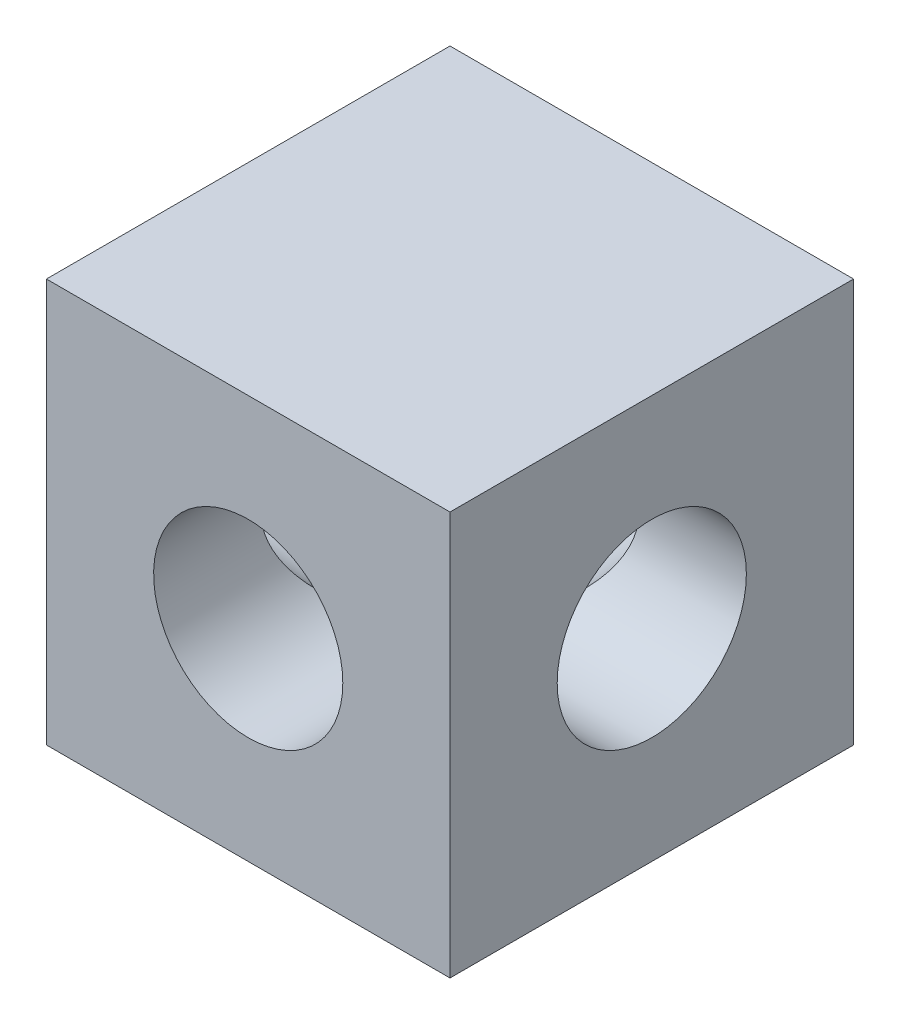
ISO-10303-21;
HEADER;
FILE_DESCRIPTION(('STEP AP214'),'2;1');
FILE_NAME('part.step','',(''),(''),'','','');
FILE_SCHEMA(('AUTOMOTIVE_DESIGN { 1 0 10303 214 1 1 1 1 }'));
ENDSEC;
DATA;
#1=APPLICATION_CONTEXT('core data for automotive mechanical design processes');
#2=APPLICATION_PROTOCOL_DEFINITION('international standard','automotive_design',2000,#1);
#3=PRODUCT_CONTEXT('',#1,'mechanical');
#4=PRODUCT('Part','Part','',(#3));
#5=PRODUCT_RELATED_PRODUCT_CATEGORY('part','',(#4));
#6=PRODUCT_DEFINITION_FORMATION('','',#4);
#7=PRODUCT_DEFINITION_CONTEXT('part definition',#1,'design');
#8=PRODUCT_DEFINITION('design','',#6,#7);
#9=PRODUCT_DEFINITION_SHAPE('','',#8);
#10=(LENGTH_UNIT() NAMED_UNIT(*) SI_UNIT(.MILLI.,.METRE.));
#11=(NAMED_UNIT(*) PLANE_ANGLE_UNIT() SI_UNIT($,.RADIAN.));
#12=(NAMED_UNIT(*) SI_UNIT($,.STERADIAN.) SOLID_ANGLE_UNIT());
#13=UNCERTAINTY_MEASURE_WITH_UNIT(LENGTH_MEASURE(1.E-05),#10,'distance_accuracy_value','');
#14=(GEOMETRIC_REPRESENTATION_CONTEXT(3) GLOBAL_UNCERTAINTY_ASSIGNED_CONTEXT((#13)) GLOBAL_UNIT_ASSIGNED_CONTEXT((#10,
#11,#12)) REPRESENTATION_CONTEXT('',''));
#15=CARTESIAN_POINT('',(0.,0.,0.));
#16=DIRECTION('',(0.,0.,1.));
#17=DIRECTION('',(1.,0.,0.));
#18=AXIS2_PLACEMENT_3D('',#15,#16,#17);
#19=CARTESIAN_POINT('',(0.,0.,10.16));
#20=DIRECTION('',(0.,0.,-0.999999999999999));
#21=DIRECTION('',(-1.,0.,0.));
#22=AXIS2_PLACEMENT_3D('',#19,#20,#21);
#23=CYLINDRICAL_SURFACE('',#22,4.7625);
#24=CARTESIAN_POINT('',(0.,0.,0.));
#25=DIRECTION('',(0.707106781186547,0.,-0.707106781186547));
#26=DIRECTION('',(-0.707106781186547,0.,-0.707106781186547));
#27=AXIS2_PLACEMENT_3D('',#24,#25,#26);
#28=ELLIPSE('',#27,6.73519209080187,4.7625);
#29=CARTESIAN_POINT('',(0.,-4.76249999999992,0.));
#30=VERTEX_POINT('',#29);
#31=CARTESIAN_POINT('',(0.,4.7625000000002,0.));
#32=VERTEX_POINT('',#31);
#33=EDGE_CURVE('E13',#30,#32,#28,.F.);
#34=ORIENTED_EDGE('',*,*,#33,.F.);
#35=CARTESIAN_POINT('',(0.,0.,0.));
#36=DIRECTION('',(-0.707106781186547,0.,-0.707106781186547));
#37=DIRECTION('',(0.707106781186547,0.,-0.707106781186547));
#38=AXIS2_PLACEMENT_3D('',#35,#36,#37);
#39=ELLIPSE('',#38,6.73519209080187,4.7625);
#40=EDGE_CURVE('E63',#32,#30,#39,.F.);
#41=ORIENTED_EDGE('',*,*,#40,.F.);
#42=EDGE_LOOP('',(#34,#41));
#43=FACE_BOUND('',#42,.T.);
#44=CARTESIAN_POINT('',(0.,0.,10.16));
#45=DIRECTION('',(0.,0.,0.999999999999999));
#46=DIRECTION('',(1.,0.,0.));
#47=AXIS2_PLACEMENT_3D('',#44,#45,#46);
#48=CIRCLE('',#47,4.7625);
#49=CARTESIAN_POINT('',(4.7625,0.,10.16));
#50=VERTEX_POINT('',#49);
#51=EDGE_CURVE('E140',#50,#50,#48,.T.);
#52=ORIENTED_EDGE('',*,*,#51,.T.);
#53=EDGE_LOOP('',(#52));
#54=FACE_BOUND('',#53,.T.);
#55=ADVANCED_FACE('F49',(#43,#54),#23,.F.);
#56=CARTESIAN_POINT('',(-10.16,10.16,10.16));
#57=DIRECTION('',(0.,0.,0.999999999999999));
#58=DIRECTION('',(1.,0.,0.));
#59=AXIS2_PLACEMENT_3D('',#56,#57,#58);
#60=PLANE('',#59);
#61=DIRECTION('',(0.,0.999999999999999,0.));
#62=VECTOR('',#61,1.);
#63=CARTESIAN_POINT('',(-10.16,-10.1599999999998,10.16));
#64=LINE('',#63,#62);
#65=CARTESIAN_POINT('',(-10.16,-10.1599999999998,10.16));
#66=VERTEX_POINT('',#65);
#67=CARTESIAN_POINT('',(-10.16,10.16,10.16));
#68=VERTEX_POINT('',#67);
#69=EDGE_CURVE('E125',#66,#68,#64,.T.);
#70=ORIENTED_EDGE('',*,*,#69,.F.);
#71=DIRECTION('',(1.,0.,0.));
#72=VECTOR('',#71,1.);
#73=CARTESIAN_POINT('',(-10.16,-10.1599999999998,10.16));
#74=LINE('',#73,#72);
#75=CARTESIAN_POINT('',(10.16,-10.1599999999998,10.16));
#76=VERTEX_POINT('',#75);
#77=EDGE_CURVE('E114',#66,#76,#74,.T.);
#78=ORIENTED_EDGE('',*,*,#77,.T.);
#79=DIRECTION('',(0.,-1.,0.));
#80=VECTOR('',#79,1.);
#81=CARTESIAN_POINT('',(10.16,10.1600000000002,10.16));
#82=LINE('',#81,#80);
#83=CARTESIAN_POINT('',(10.16,10.1600000000002,10.16));
#84=VERTEX_POINT('',#83);
#85=EDGE_CURVE('E120',#84,#76,#82,.T.);
#86=ORIENTED_EDGE('',*,*,#85,.F.);
#87=DIRECTION('',(-1.,0.,0.));
#88=VECTOR('',#87,1.);
#89=CARTESIAN_POINT('',(10.16,10.1600000000002,10.16));
#90=LINE('',#89,#88);
#91=EDGE_CURVE('E123',#84,#68,#90,.T.);
#92=ORIENTED_EDGE('',*,*,#91,.T.);
#93=EDGE_LOOP('',(#70,#78,#86,#92));
#94=FACE_BOUND('',#93,.T.);
#95=ORIENTED_EDGE('',*,*,#51,.F.);
#96=EDGE_LOOP('',(#95));
#97=FACE_BOUND('',#96,.T.);
#98=ADVANCED_FACE('F172',(#94,#97),#60,.T.);
#99=CARTESIAN_POINT('',(-10.16,10.16,-10.16));
#100=DIRECTION('',(0.,0.,0.999999999999999));
#101=DIRECTION('',(1.,0.,0.));
#102=AXIS2_PLACEMENT_3D('',#99,#100,#101);
#103=PLANE('',#102);
#104=DIRECTION('',(0.,0.999999999999999,0.));
#105=VECTOR('',#104,1.);
#106=CARTESIAN_POINT('',(-10.16,-10.1599999999998,-10.16));
#107=LINE('',#106,#105);
#108=CARTESIAN_POINT('',(-10.16,-10.1599999999998,-10.16));
#109=VERTEX_POINT('',#108);
#110=CARTESIAN_POINT('',(-10.16,10.16,-10.16));
#111=VERTEX_POINT('',#110);
#112=EDGE_CURVE('E137',#109,#111,#107,.T.);
#113=ORIENTED_EDGE('',*,*,#112,.T.);
#114=DIRECTION('',(-1.,0.,0.));
#115=VECTOR('',#114,1.);
#116=CARTESIAN_POINT('',(10.16,10.1600000000002,-10.16));
#117=LINE('',#116,#115);
#118=CARTESIAN_POINT('',(10.16,10.1600000000002,-10.16));
#119=VERTEX_POINT('',#118);
#120=EDGE_CURVE('E134',#119,#111,#117,.T.);
#121=ORIENTED_EDGE('',*,*,#120,.F.);
#122=DIRECTION('',(0.,-1.,0.));
#123=VECTOR('',#122,1.);
#124=CARTESIAN_POINT('',(10.16,10.1600000000002,-10.16));
#125=LINE('',#124,#123);
#126=CARTESIAN_POINT('',(10.16,-10.1599999999998,-10.16));
#127=VERTEX_POINT('',#126);
#128=EDGE_CURVE('E131',#119,#127,#125,.T.);
#129=ORIENTED_EDGE('',*,*,#128,.T.);
#130=DIRECTION('',(1.,0.,0.));
#131=VECTOR('',#130,1.);
#132=CARTESIAN_POINT('',(-10.16,-10.1599999999998,-10.16));
#133=LINE('',#132,#131);
#134=EDGE_CURVE('E128',#109,#127,#133,.T.);
#135=ORIENTED_EDGE('',*,*,#134,.F.);
#136=EDGE_LOOP('',(#113,#121,#129,#135));
#137=FACE_BOUND('',#136,.T.);
#138=CARTESIAN_POINT('',(0.,0.,-10.16));
#139=DIRECTION('',(0.,0.,0.999999999999999));
#140=DIRECTION('',(1.,0.,0.));
#141=AXIS2_PLACEMENT_3D('',#138,#139,#140);
#142=CIRCLE('',#141,4.7625);
#143=CARTESIAN_POINT('',(4.7625,0.,-10.16));
#144=VERTEX_POINT('',#143);
#145=EDGE_CURVE('E143',#144,#144,#142,.T.);
#146=ORIENTED_EDGE('',*,*,#145,.T.);
#147=EDGE_LOOP('',(#146));
#148=FACE_BOUND('',#147,.T.);
#149=ADVANCED_FACE('F165',(#137,#148),#103,.F.);
#150=CARTESIAN_POINT('',(-10.16,-10.1599999999998,10.16));
#151=DIRECTION('',(-1.,0.,0.));
#152=DIRECTION('',(0.,-0.999999999999999,0.));
#153=AXIS2_PLACEMENT_3D('',#150,#151,#152);
#154=PLANE('',#153);
#155=CARTESIAN_POINT('',(-10.16,1.66533453693773E-13,0.));
#156=DIRECTION('',(1.,0.,0.));
#157=DIRECTION('',(0.,0.,-0.999999999999999));
#158=AXIS2_PLACEMENT_3D('',#155,#156,#157);
#159=CIRCLE('',#158,4.7625);
#160=CARTESIAN_POINT('',(-10.16,1.66599546658208E-13,-4.76249999999999));
#161=VERTEX_POINT('',#160);
#162=EDGE_CURVE('E146',#161,#161,#159,.T.);
#163=ORIENTED_EDGE('',*,*,#162,.T.);
#164=EDGE_LOOP('',(#163));
#165=FACE_BOUND('',#164,.T.);
#166=ORIENTED_EDGE('',*,*,#112,.F.);
#167=DIRECTION('',(0.,0.,-0.999999999999999));
#168=VECTOR('',#167,1.);
#169=CARTESIAN_POINT('',(-10.16,-10.1599999999998,10.16));
#170=LINE('',#169,#168);
#171=EDGE_CURVE('E71',#66,#109,#170,.T.);
#172=ORIENTED_EDGE('',*,*,#171,.F.);
#173=ORIENTED_EDGE('',*,*,#69,.T.);
#174=DIRECTION('',(0.,0.,-0.999999999999999));
#175=VECTOR('',#174,1.);
#176=CARTESIAN_POINT('',(-10.16,10.16,10.16));
#177=LINE('',#176,#175);
#178=EDGE_CURVE('E111',#68,#111,#177,.T.);
#179=ORIENTED_EDGE('',*,*,#178,.T.);
#180=EDGE_LOOP('',(#166,#172,#173,#179));
#181=FACE_BOUND('',#180,.T.);
#182=ADVANCED_FACE('F51',(#165,#181),#154,.T.);
#183=CARTESIAN_POINT('',(-10.16,-10.1599999999998,10.16));
#184=DIRECTION('',(0.,1.,0.));
#185=DIRECTION('',(0.,0.,0.999999999999999));
#186=AXIS2_PLACEMENT_3D('',#183,#184,#185);
#187=PLANE('',#186);
#188=ORIENTED_EDGE('',*,*,#134,.T.);
#189=DIRECTION('',(0.,0.,-0.999999999999999));
#190=VECTOR('',#189,1.);
#191=CARTESIAN_POINT('',(10.16,-10.1599999999998,10.16));
#192=LINE('',#191,#190);
#193=EDGE_CURVE('E116',#76,#127,#192,.T.);
#194=ORIENTED_EDGE('',*,*,#193,.F.);
#195=ORIENTED_EDGE('',*,*,#77,.F.);
#196=ORIENTED_EDGE('',*,*,#171,.T.);
#197=EDGE_LOOP('',(#188,#194,#195,#196));
#198=FACE_BOUND('',#197,.T.);
#199=ADVANCED_FACE('F157',(#198),#187,.F.);
#200=CARTESIAN_POINT('',(10.16,10.1600000000002,10.16));
#201=DIRECTION('',(1.,0.,0.));
#202=DIRECTION('',(0.,0.,-0.999999999999999));
#203=AXIS2_PLACEMENT_3D('',#200,#201,#202);
#204=PLANE('',#203);
#205=CARTESIAN_POINT('',(10.16,0.,0.));
#206=DIRECTION('',(1.,0.,0.));
#207=DIRECTION('',(0.,0.,-0.999999999999999));
#208=AXIS2_PLACEMENT_3D('',#205,#206,#207);
#209=CIRCLE('',#208,4.7625);
#210=CARTESIAN_POINT('',(10.16,0.,-4.7625));
#211=VERTEX_POINT('',#210);
#212=EDGE_CURVE('E149',#211,#211,#209,.T.);
#213=ORIENTED_EDGE('',*,*,#212,.F.);
#214=EDGE_LOOP('',(#213));
#215=FACE_BOUND('',#214,.T.);
#216=ORIENTED_EDGE('',*,*,#128,.F.);
#217=DIRECTION('',(0.,0.,-0.999999999999999));
#218=VECTOR('',#217,1.);
#219=CARTESIAN_POINT('',(10.16,10.1600000000002,10.16));
#220=LINE('',#219,#218);
#221=EDGE_CURVE('E113',#84,#119,#220,.T.);
#222=ORIENTED_EDGE('',*,*,#221,.F.);
#223=ORIENTED_EDGE('',*,*,#85,.T.);
#224=ORIENTED_EDGE('',*,*,#193,.T.);
#225=EDGE_LOOP('',(#216,#222,#223,#224));
#226=FACE_BOUND('',#225,.T.);
#227=ADVANCED_FACE('F153',(#215,#226),#204,.T.);
#228=CARTESIAN_POINT('',(10.16,10.1600000000002,10.16));
#229=DIRECTION('',(0.,-1.,0.));
#230=DIRECTION('',(0.,0.,-0.999999999999999));
#231=AXIS2_PLACEMENT_3D('',#228,#229,#230);
#232=PLANE('',#231);
#233=ORIENTED_EDGE('',*,*,#120,.T.);
#234=ORIENTED_EDGE('',*,*,#178,.F.);
#235=ORIENTED_EDGE('',*,*,#91,.F.);
#236=ORIENTED_EDGE('',*,*,#221,.T.);
#237=EDGE_LOOP('',(#233,#234,#235,#236));
#238=FACE_BOUND('',#237,.T.);
#239=ADVANCED_FACE('F156',(#238),#232,.F.);
#240=CARTESIAN_POINT('',(0.,0.,0.));
#241=DIRECTION('',(0.707106781186547,0.,-0.707106781186547));
#242=DIRECTION('',(-0.707106781186547,0.,-0.707106781186547));
#243=AXIS2_PLACEMENT_3D('',#240,#241,#242);
#244=ELLIPSE('',#243,6.73519209080187,4.7625);
#245=EDGE_CURVE('E57',#30,#32,#244,.T.);
#246=ORIENTED_EDGE('',*,*,#245,.F.);
#247=CARTESIAN_POINT('',(0.,0.,0.));
#248=DIRECTION('',(-0.707106781186547,0.,-0.707106781186547));
#249=DIRECTION('',(0.707106781186547,0.,-0.707106781186547));
#250=AXIS2_PLACEMENT_3D('',#247,#248,#249);
#251=ELLIPSE('',#250,6.73519209080187,4.7625);
#252=EDGE_CURVE('E97',#32,#30,#251,.T.);
#253=ORIENTED_EDGE('',*,*,#252,.F.);
#254=EDGE_LOOP('',(#246,#253));
#255=FACE_BOUND('',#254,.T.);
#256=ORIENTED_EDGE('',*,*,#145,.F.);
#257=EDGE_LOOP('',(#256));
#258=FACE_BOUND('',#257,.T.);
#259=ADVANCED_FACE('F108',(#255,#258),#23,.F.);
#260=CARTESIAN_POINT('',(-10.16,1.66533453693773E-13,0.));
#261=DIRECTION('',(1.,0.,0.));
#262=DIRECTION('',(0.,0.,-0.999999999999999));
#263=AXIS2_PLACEMENT_3D('',#260,#261,#262);
#264=CYLINDRICAL_SURFACE('',#263,4.7625);
#265=ORIENTED_EDGE('',*,*,#245,.T.);
#266=ORIENTED_EDGE('',*,*,#40,.T.);
#267=EDGE_LOOP('',(#265,#266));
#268=FACE_BOUND('',#267,.T.);
#269=ORIENTED_EDGE('',*,*,#162,.F.);
#270=EDGE_LOOP('',(#269));
#271=FACE_BOUND('',#270,.T.);
#272=ADVANCED_FACE('F104',(#268,#271),#264,.F.);
#273=ORIENTED_EDGE('',*,*,#33,.T.);
#274=ORIENTED_EDGE('',*,*,#252,.T.);
#275=EDGE_LOOP('',(#273,#274));
#276=FACE_BOUND('',#275,.T.);
#277=ORIENTED_EDGE('',*,*,#212,.T.);
#278=EDGE_LOOP('',(#277));
#279=FACE_BOUND('',#278,.T.);
#280=ADVANCED_FACE('F98',(#276,#279),#264,.F.);
#281=CLOSED_SHELL('',(#55,#98,#149,#182,#199,#227,#239,#259,#272,#280));
#282=MANIFOLD_SOLID_BREP('B2',#281);
#283=ADVANCED_BREP_SHAPE_REPRESENTATION('',(#18,#282),#14);
#284=SHAPE_DEFINITION_REPRESENTATION(#9,#283);
ENDSEC;
END-ISO-10303-21;
